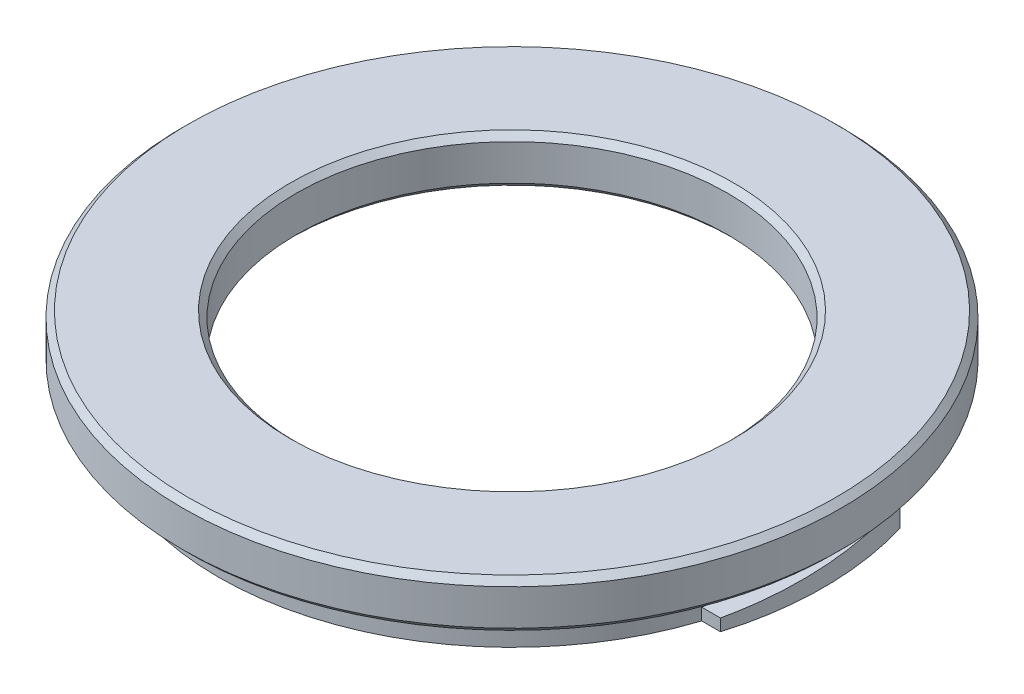
ISO-10303-21;
HEADER;
FILE_DESCRIPTION(('STEP AP214'),'2;1');
FILE_NAME('part.step','',(''),(''),'','','');
FILE_SCHEMA(('AUTOMOTIVE_DESIGN { 1 0 10303 214 1 1 1 1 }'));
ENDSEC;
DATA;
#1=APPLICATION_CONTEXT('core data for automotive mechanical design processes');
#2=APPLICATION_PROTOCOL_DEFINITION('international standard','automotive_design',2000,#1);
#3=PRODUCT_CONTEXT('',#1,'mechanical');
#4=PRODUCT('Part','Part','',(#3));
#5=PRODUCT_RELATED_PRODUCT_CATEGORY('part','',(#4));
#6=PRODUCT_DEFINITION_FORMATION('','',#4);
#7=PRODUCT_DEFINITION_CONTEXT('part definition',#1,'design');
#8=PRODUCT_DEFINITION('design','',#6,#7);
#9=PRODUCT_DEFINITION_SHAPE('','',#8);
#10=(LENGTH_UNIT() NAMED_UNIT(*) SI_UNIT(.MILLI.,.METRE.));
#11=(NAMED_UNIT(*) PLANE_ANGLE_UNIT() SI_UNIT($,.RADIAN.));
#12=(NAMED_UNIT(*) SI_UNIT($,.STERADIAN.) SOLID_ANGLE_UNIT());
#13=UNCERTAINTY_MEASURE_WITH_UNIT(LENGTH_MEASURE(1.E-05),#10,'distance_accuracy_value','');
#14=(GEOMETRIC_REPRESENTATION_CONTEXT(3) GLOBAL_UNCERTAINTY_ASSIGNED_CONTEXT((#13)) GLOBAL_UNIT_ASSIGNED_CONTEXT((#10,
#11,#12)) REPRESENTATION_CONTEXT('',''));
#15=CARTESIAN_POINT('',(0.,0.,0.));
#16=DIRECTION('',(0.,0.,1.));
#17=DIRECTION('',(1.,0.,0.));
#18=AXIS2_PLACEMENT_3D('',#15,#16,#17);
#19=CARTESIAN_POINT('',(0.,-13.5086932447398,0.));
#20=DIRECTION('',(0.,-1.,0.));
#21=DIRECTION('',(0.,0.,-1.));
#22=AXIS2_PLACEMENT_3D('',#19,#20,#21);
#23=CYLINDRICAL_SURFACE('',#22,24.5);
#24=CARTESIAN_POINT('',(0.,-4.,0.));
#25=DIRECTION('',(0.,-1.,0.));
#26=DIRECTION('',(0.,0.,-1.));
#27=AXIS2_PLACEMENT_3D('',#24,#25,#26);
#28=CIRCLE('',#27,24.5);
#29=CARTESIAN_POINT('',(0.,-4.,-24.5));
#30=VERTEX_POINT('',#29);
#31=EDGE_CURVE('E155',#30,#30,#28,.T.);
#32=ORIENTED_EDGE('',*,*,#31,.T.);
#33=EDGE_LOOP('',(#32));
#34=FACE_BOUND('',#33,.T.);
#35=DIRECTION('',(0.,-1.,0.));
#36=VECTOR('',#35,1.);
#37=CARTESIAN_POINT('',(-23.3238075793812,-13.5086932447398,7.5));
#38=LINE('',#37,#36);
#39=CARTESIAN_POINT('',(-23.3238075793812,-7.,7.5));
#40=VERTEX_POINT('',#39);
#41=CARTESIAN_POINT('',(-23.3238075793812,-5.,7.5));
#42=VERTEX_POINT('',#41);
#43=EDGE_CURVE('E134',#40,#42,#38,.F.);
#44=ORIENTED_EDGE('',*,*,#43,.F.);
#45=CARTESIAN_POINT('',(0.,-7.,0.));
#46=DIRECTION('',(0.,-1.,0.));
#47=DIRECTION('',(0.,0.,-1.));
#48=AXIS2_PLACEMENT_3D('',#45,#46,#47);
#49=CIRCLE('',#48,24.5);
#50=CARTESIAN_POINT('',(23.3238075793812,-7.,7.5));
#51=VERTEX_POINT('',#50);
#52=EDGE_CURVE('E122',#51,#40,#49,.T.);
#53=ORIENTED_EDGE('',*,*,#52,.F.);
#54=DIRECTION('',(0.,-1.,0.));
#55=VECTOR('',#54,1.);
#56=CARTESIAN_POINT('',(23.3238075793812,-13.5086932447398,7.5));
#57=LINE('',#56,#55);
#58=CARTESIAN_POINT('',(23.3238075793812,-6.,7.5));
#59=VERTEX_POINT('',#58);
#60=EDGE_CURVE('E144',#59,#51,#57,.T.);
#61=ORIENTED_EDGE('',*,*,#60,.F.);
#62=CARTESIAN_POINT('',(0.,-5.5,0.));
#63=DIRECTION('',(0.,-0.997785157856609,-0.066519010523774));
#64=DIRECTION('',(0.,-0.066519010523774,0.997785157856609));
#65=AXIS2_PLACEMENT_3D('',#62,#63,#64);
#66=ELLIPSE('',#65,24.5543840846757,24.5);
#67=CARTESIAN_POINT('',(23.3238075793812,-5.,-7.5));
#68=VERTEX_POINT('',#67);
#69=EDGE_CURVE('E147',#68,#59,#66,.T.);
#70=ORIENTED_EDGE('',*,*,#69,.F.);
#71=DIRECTION('',(0.,-1.,0.));
#72=VECTOR('',#71,1.);
#73=CARTESIAN_POINT('',(23.3238075793812,-13.5086932447398,-7.5));
#74=LINE('',#73,#72);
#75=CARTESIAN_POINT('',(23.3238075793812,-7.,-7.5));
#76=VERTEX_POINT('',#75);
#77=EDGE_CURVE('E150',#76,#68,#74,.F.);
#78=ORIENTED_EDGE('',*,*,#77,.F.);
#79=CARTESIAN_POINT('',(-23.3238075793812,-7.,-7.5));
#80=VERTEX_POINT('',#79);
#81=EDGE_CURVE('E153',#80,#76,#49,.T.);
#82=ORIENTED_EDGE('',*,*,#81,.F.);
#83=DIRECTION('',(0.,-1.,0.));
#84=VECTOR('',#83,1.);
#85=CARTESIAN_POINT('',(-23.3238075793812,-13.5086932447398,-7.5));
#86=LINE('',#85,#84);
#87=CARTESIAN_POINT('',(-23.3238075793812,-6.,-7.5));
#88=VERTEX_POINT('',#87);
#89=EDGE_CURVE('E123',#88,#80,#86,.T.);
#90=ORIENTED_EDGE('',*,*,#89,.F.);
#91=CARTESIAN_POINT('',(0.,-5.5,0.));
#92=DIRECTION('',(0.,-0.997785157856609,0.066519010523774));
#93=DIRECTION('',(0.,-0.066519010523774,-0.997785157856609));
#94=AXIS2_PLACEMENT_3D('',#91,#92,#93);
#95=ELLIPSE('',#94,24.5543840846757,24.5);
#96=EDGE_CURVE('E126',#42,#88,#95,.T.);
#97=ORIENTED_EDGE('',*,*,#96,.F.);
#98=EDGE_LOOP('',(#44,#53,#61,#70,#78,#82,#90,#97));
#99=FACE_BOUND('',#98,.T.);
#100=ADVANCED_FACE('F37',(#34,#99),#23,.T.);
#101=CARTESIAN_POINT('',(0.,-13.5086932447398,0.));
#102=DIRECTION('',(0.,-1.,0.));
#103=DIRECTION('',(0.,0.,-1.));
#104=AXIS2_PLACEMENT_3D('',#101,#102,#103);
#105=CYLINDRICAL_SURFACE('',#104,22.5);
#106=CARTESIAN_POINT('',(0.,-6.5,0.));
#107=DIRECTION('',(0.,1.,0.));
#108=DIRECTION('',(0.,0.,1.));
#109=AXIS2_PLACEMENT_3D('',#106,#107,#108);
#110=CIRCLE('',#109,22.5);
#111=CARTESIAN_POINT('',(0.,-6.5,22.5));
#112=VERTEX_POINT('',#111);
#113=EDGE_CURVE('E165',#112,#112,#110,.F.);
#114=ORIENTED_EDGE('',*,*,#113,.T.);
#115=EDGE_LOOP('',(#114));
#116=FACE_BOUND('',#115,.T.);
#117=CARTESIAN_POINT('',(0.,-5.,0.));
#118=DIRECTION('',(0.,-1.,0.));
#119=DIRECTION('',(0.,0.,-1.));
#120=AXIS2_PLACEMENT_3D('',#117,#118,#119);
#121=CIRCLE('',#120,22.5);
#122=CARTESIAN_POINT('',(0.,-5.,-22.5));
#123=VERTEX_POINT('',#122);
#124=EDGE_CURVE('E162',#123,#123,#121,.F.);
#125=ORIENTED_EDGE('',*,*,#124,.T.);
#126=EDGE_LOOP('',(#125));
#127=FACE_BOUND('',#126,.T.);
#128=ADVANCED_FACE('F208',(#116,#127),#105,.F.);
#129=CARTESIAN_POINT('',(0.,0.,0.));
#130=DIRECTION('',(0.,1.,0.));
#131=DIRECTION('',(0.,0.,1.));
#132=AXIS2_PLACEMENT_3D('',#129,#130,#131);
#133=PLANE('',#132);
#134=CARTESIAN_POINT('',(0.,0.,0.));
#135=DIRECTION('',(0.,1.,0.));
#136=DIRECTION('',(0.,0.,1.));
#137=AXIS2_PLACEMENT_3D('',#134,#135,#136);
#138=CIRCLE('',#137,27.);
#139=CARTESIAN_POINT('',(0.,0.,27.));
#140=VERTEX_POINT('',#139);
#141=EDGE_CURVE('E180',#140,#140,#138,.T.);
#142=ORIENTED_EDGE('',*,*,#141,.T.);
#143=EDGE_LOOP('',(#142));
#144=FACE_BOUND('',#143,.T.);
#145=CARTESIAN_POINT('',(0.,0.,0.));
#146=DIRECTION('',(0.,1.,0.));
#147=DIRECTION('',(0.,0.,1.));
#148=AXIS2_PLACEMENT_3D('',#145,#146,#147);
#149=CIRCLE('',#148,18.5);
#150=CARTESIAN_POINT('',(0.,0.,18.5));
#151=VERTEX_POINT('',#150);
#152=EDGE_CURVE('E177',#151,#151,#149,.F.);
#153=ORIENTED_EDGE('',*,*,#152,.T.);
#154=EDGE_LOOP('',(#153));
#155=FACE_BOUND('',#154,.T.);
#156=ADVANCED_FACE('F214',(#144,#155),#133,.T.);
#157=CARTESIAN_POINT('',(0.,-13.5086932447398,0.));
#158=DIRECTION('',(0.,-1.,0.));
#159=DIRECTION('',(0.,0.,-1.));
#160=AXIS2_PLACEMENT_3D('',#157,#158,#159);
#161=CYLINDRICAL_SURFACE('',#160,27.5);
#162=CARTESIAN_POINT('',(0.,-0.499999999999997,0.));
#163=DIRECTION('',(0.,1.,0.));
#164=DIRECTION('',(0.,0.,1.));
#165=AXIS2_PLACEMENT_3D('',#162,#163,#164);
#166=CIRCLE('',#165,27.5);
#167=CARTESIAN_POINT('',(0.,-0.499999999999997,27.5));
#168=VERTEX_POINT('',#167);
#169=EDGE_CURVE('E174',#168,#168,#166,.F.);
#170=ORIENTED_EDGE('',*,*,#169,.T.);
#171=EDGE_LOOP('',(#170));
#172=FACE_BOUND('',#171,.T.);
#173=CARTESIAN_POINT('',(0.,-3.49999999999999,0.));
#174=DIRECTION('',(0.,-1.,0.));
#175=DIRECTION('',(0.,0.,-1.));
#176=AXIS2_PLACEMENT_3D('',#173,#174,#175);
#177=CIRCLE('',#176,27.5);
#178=CARTESIAN_POINT('',(0.,-3.49999999999999,-27.5));
#179=VERTEX_POINT('',#178);
#180=EDGE_CURVE('E171',#179,#179,#177,.F.);
#181=ORIENTED_EDGE('',*,*,#180,.T.);
#182=EDGE_LOOP('',(#181));
#183=FACE_BOUND('',#182,.T.);
#184=ADVANCED_FACE('F220',(#172,#183),#161,.T.);
#185=CARTESIAN_POINT('',(0.,-4.,0.));
#186=DIRECTION('',(0.,-1.,0.));
#187=DIRECTION('',(0.,0.,-1.));
#188=AXIS2_PLACEMENT_3D('',#185,#186,#187);
#189=PLANE('',#188);
#190=CARTESIAN_POINT('',(0.,-4.,0.));
#191=DIRECTION('',(0.,-1.,0.));
#192=DIRECTION('',(0.,0.,-1.));
#193=AXIS2_PLACEMENT_3D('',#190,#191,#192);
#194=CIRCLE('',#193,27.);
#195=CARTESIAN_POINT('',(0.,-4.,-27.));
#196=VERTEX_POINT('',#195);
#197=EDGE_CURVE('E183',#196,#196,#194,.T.);
#198=ORIENTED_EDGE('',*,*,#197,.T.);
#199=EDGE_LOOP('',(#198));
#200=FACE_BOUND('',#199,.T.);
#201=ORIENTED_EDGE('',*,*,#31,.F.);
#202=EDGE_LOOP('',(#201));
#203=FACE_BOUND('',#202,.T.);
#204=ADVANCED_FACE('F223',(#200,#203),#189,.T.);
#205=CARTESIAN_POINT('',(0.,-7.,0.));
#206=DIRECTION('',(0.,1.,0.));
#207=DIRECTION('',(0.,0.,1.));
#208=AXIS2_PLACEMENT_3D('',#205,#206,#207);
#209=PLANE('',#208);
#210=CARTESIAN_POINT('',(0.,-7.,0.));
#211=DIRECTION('',(0.,1.,0.));
#212=DIRECTION('',(0.,0.,1.));
#213=AXIS2_PLACEMENT_3D('',#210,#211,#212);
#214=CIRCLE('',#213,23.);
#215=CARTESIAN_POINT('',(0.,-7.,23.));
#216=VERTEX_POINT('',#215);
#217=EDGE_CURVE('E168',#216,#216,#214,.T.);
#218=ORIENTED_EDGE('',*,*,#217,.T.);
#219=EDGE_LOOP('',(#218));
#220=FACE_BOUND('',#219,.T.);
#221=DIRECTION('',(1.,0.,0.));
#222=VECTOR('',#221,1.);
#223=CARTESIAN_POINT('',(-30.,-7.,7.5));
#224=LINE('',#223,#222);
#225=CARTESIAN_POINT('',(-24.8947785690092,-7.,7.5));
#226=VERTEX_POINT('',#225);
#227=EDGE_CURVE('E114',#226,#40,#224,.T.);
#228=ORIENTED_EDGE('',*,*,#227,.F.);
#229=CARTESIAN_POINT('',(0.,-7.,0.));
#230=DIRECTION('',(0.,1.,0.));
#231=DIRECTION('',(-1.,0.,0.));
#232=AXIS2_PLACEMENT_3D('',#229,#230,#231);
#233=CIRCLE('',#232,26.);
#234=CARTESIAN_POINT('',(-24.8947785690092,-7.,-7.5));
#235=VERTEX_POINT('',#234);
#236=EDGE_CURVE('E100',#235,#226,#233,.T.);
#237=ORIENTED_EDGE('',*,*,#236,.F.);
#238=DIRECTION('',(1.,0.,0.));
#239=VECTOR('',#238,1.);
#240=CARTESIAN_POINT('',(-30.,-7.,-7.5));
#241=LINE('',#240,#239);
#242=EDGE_CURVE('E423',#235,#80,#241,.T.);
#243=ORIENTED_EDGE('',*,*,#242,.T.);
#244=ORIENTED_EDGE('',*,*,#81,.T.);
#245=DIRECTION('',(-1.,0.,0.));
#246=VECTOR('',#245,1.);
#247=CARTESIAN_POINT('',(30.,-7.,-7.5));
#248=LINE('',#247,#246);
#249=CARTESIAN_POINT('',(24.8947785690092,-6.99999999999999,-7.5));
#250=VERTEX_POINT('',#249);
#251=EDGE_CURVE('E142',#250,#76,#248,.T.);
#252=ORIENTED_EDGE('',*,*,#251,.F.);
#253=CARTESIAN_POINT('',(24.8947785690092,-6.99999999999999,7.5));
#254=VERTEX_POINT('',#253);
#255=EDGE_CURVE('E108',#254,#250,#233,.T.);
#256=ORIENTED_EDGE('',*,*,#255,.F.);
#257=DIRECTION('',(-1.,0.,0.));
#258=VECTOR('',#257,1.);
#259=CARTESIAN_POINT('',(30.,-7.,7.5));
#260=LINE('',#259,#258);
#261=EDGE_CURVE('E136',#254,#51,#260,.T.);
#262=ORIENTED_EDGE('',*,*,#261,.T.);
#263=ORIENTED_EDGE('',*,*,#52,.T.);
#264=EDGE_LOOP('',(#228,#237,#243,#244,#252,#256,#262,#263));
#265=FACE_BOUND('',#264,.T.);
#266=ADVANCED_FACE('F120',(#220,#265),#209,.F.);
#267=CARTESIAN_POINT('',(0.,-4.,0.));
#268=DIRECTION('',(0.,-1.,0.));
#269=DIRECTION('',(0.,0.,-1.));
#270=AXIS2_PLACEMENT_3D('',#267,#268,#269);
#271=CIRCLE('',#270,18.5);
#272=CARTESIAN_POINT('',(0.,-4.,-18.5));
#273=VERTEX_POINT('',#272);
#274=EDGE_CURVE('E11',#273,#273,#271,.F.);
#275=ORIENTED_EDGE('',*,*,#274,.T.);
#276=EDGE_LOOP('',(#275));
#277=FACE_BOUND('',#276,.T.);
#278=CARTESIAN_POINT('',(0.,-4.,0.));
#279=DIRECTION('',(0.,-1.,0.));
#280=DIRECTION('',(0.,0.,-1.));
#281=AXIS2_PLACEMENT_3D('',#278,#279,#280);
#282=CIRCLE('',#281,21.5);
#283=CARTESIAN_POINT('',(0.,-4.,-21.5));
#284=VERTEX_POINT('',#283);
#285=EDGE_CURVE('E159',#284,#284,#282,.T.);
#286=ORIENTED_EDGE('',*,*,#285,.T.);
#287=EDGE_LOOP('',(#286));
#288=FACE_BOUND('',#287,.T.);
#289=ADVANCED_FACE('F252',(#277,#288),#189,.T.);
#290=CARTESIAN_POINT('',(0.,-13.5086932447398,0.));
#291=DIRECTION('',(0.,-1.,0.));
#292=DIRECTION('',(0.,0.,-1.));
#293=AXIS2_PLACEMENT_3D('',#290,#291,#292);
#294=CYLINDRICAL_SURFACE('',#293,18.);
#295=CARTESIAN_POINT('',(0.,-3.5,0.));
#296=DIRECTION('',(0.,-1.,0.));
#297=DIRECTION('',(0.,0.,-1.));
#298=AXIS2_PLACEMENT_3D('',#295,#296,#297);
#299=CIRCLE('',#298,18.);
#300=CARTESIAN_POINT('',(0.,-3.5,-18.));
#301=VERTEX_POINT('',#300);
#302=EDGE_CURVE('E45',#301,#301,#299,.T.);
#303=ORIENTED_EDGE('',*,*,#302,.T.);
#304=EDGE_LOOP('',(#303));
#305=FACE_BOUND('',#304,.T.);
#306=CARTESIAN_POINT('',(0.,-0.500000000000011,0.));
#307=DIRECTION('',(0.,1.,0.));
#308=DIRECTION('',(0.,0.,1.));
#309=AXIS2_PLACEMENT_3D('',#306,#307,#308);
#310=CIRCLE('',#309,18.);
#311=CARTESIAN_POINT('',(0.,-0.500000000000011,18.));
#312=VERTEX_POINT('',#311);
#313=EDGE_CURVE('E186',#312,#312,#310,.T.);
#314=ORIENTED_EDGE('',*,*,#313,.T.);
#315=EDGE_LOOP('',(#314));
#316=FACE_BOUND('',#315,.T.);
#317=ADVANCED_FACE('F191',(#305,#316),#294,.F.);
#318=CARTESIAN_POINT('',(30.,-5.,-7.5));
#319=DIRECTION('',(0.,0.,1.));
#320=DIRECTION('',(1.,0.,0.));
#321=AXIS2_PLACEMENT_3D('',#318,#319,#320);
#322=PLANE('',#321);
#323=DIRECTION('',(-1.,0.,0.));
#324=VECTOR('',#323,1.);
#325=CARTESIAN_POINT('',(30.,-5.,-7.5));
#326=LINE('',#325,#324);
#327=CARTESIAN_POINT('',(24.8947785690092,-5.,-7.5));
#328=VERTEX_POINT('',#327);
#329=EDGE_CURVE('E140',#328,#68,#326,.T.);
#330=ORIENTED_EDGE('',*,*,#329,.F.);
#331=DIRECTION('',(0.,1.,0.));
#332=VECTOR('',#331,1.);
#333=CARTESIAN_POINT('',(24.8947785690092,1.41062813627627,-7.5));
#334=LINE('',#333,#332);
#335=EDGE_CURVE('E428',#328,#250,#334,.F.);
#336=ORIENTED_EDGE('',*,*,#335,.T.);
#337=ORIENTED_EDGE('',*,*,#251,.T.);
#338=ORIENTED_EDGE('',*,*,#77,.T.);
#339=EDGE_LOOP('',(#330,#336,#337,#338));
#340=FACE_BOUND('',#339,.T.);
#341=ADVANCED_FACE('F264',(#340),#322,.F.);
#342=CARTESIAN_POINT('',(30.,-6.,7.5));
#343=DIRECTION('',(0.,-0.997785157856609,-0.066519010523774));
#344=DIRECTION('',(0.,0.066519010523774,-0.997785157856609));
#345=AXIS2_PLACEMENT_3D('',#342,#343,#344);
#346=PLANE('',#345);
#347=DIRECTION('',(-1.,0.,0.));
#348=VECTOR('',#347,1.);
#349=CARTESIAN_POINT('',(30.,-6.,7.5));
#350=LINE('',#349,#348);
#351=CARTESIAN_POINT('',(24.8947785690092,-6.,7.5));
#352=VERTEX_POINT('',#351);
#353=EDGE_CURVE('E138',#352,#59,#350,.T.);
#354=ORIENTED_EDGE('',*,*,#353,.F.);
#355=CARTESIAN_POINT('',(0.,-5.5,0.));
#356=DIRECTION('',(0.,-0.997785157856609,-0.066519010523774));
#357=DIRECTION('',(0.,0.066519010523774,-0.997785157856609));
#358=AXIS2_PLACEMENT_3D('',#355,#356,#357);
#359=ELLIPSE('',#358,26.057713722513,26.);
#360=EDGE_CURVE('E52',#352,#328,#359,.F.);
#361=ORIENTED_EDGE('',*,*,#360,.T.);
#362=ORIENTED_EDGE('',*,*,#329,.T.);
#363=ORIENTED_EDGE('',*,*,#69,.T.);
#364=EDGE_LOOP('',(#354,#361,#362,#363));
#365=FACE_BOUND('',#364,.T.);
#366=ADVANCED_FACE('F271',(#365),#346,.F.);
#367=CARTESIAN_POINT('',(30.,-7.,7.5));
#368=DIRECTION('',(0.,0.,-1.));
#369=DIRECTION('',(-1.,0.,0.));
#370=AXIS2_PLACEMENT_3D('',#367,#368,#369);
#371=PLANE('',#370);
#372=ORIENTED_EDGE('',*,*,#261,.F.);
#373=DIRECTION('',(0.,1.,0.));
#374=VECTOR('',#373,1.);
#375=CARTESIAN_POINT('',(24.8947785690092,1.41062813627627,7.5));
#376=LINE('',#375,#374);
#377=EDGE_CURVE('E117',#254,#352,#376,.T.);
#378=ORIENTED_EDGE('',*,*,#377,.T.);
#379=ORIENTED_EDGE('',*,*,#353,.T.);
#380=ORIENTED_EDGE('',*,*,#60,.T.);
#381=EDGE_LOOP('',(#372,#378,#379,#380));
#382=FACE_BOUND('',#381,.T.);
#383=ADVANCED_FACE('F277',(#382),#371,.F.);
#384=CARTESIAN_POINT('',(-30.,-5.,7.5));
#385=DIRECTION('',(0.,0.,-1.));
#386=DIRECTION('',(-1.,0.,0.));
#387=AXIS2_PLACEMENT_3D('',#384,#385,#386);
#388=PLANE('',#387);
#389=DIRECTION('',(1.,0.,0.));
#390=VECTOR('',#389,1.);
#391=CARTESIAN_POINT('',(-30.,-5.,7.5));
#392=LINE('',#391,#390);
#393=CARTESIAN_POINT('',(-24.8947785690092,-5.,7.5));
#394=VERTEX_POINT('',#393);
#395=EDGE_CURVE('E116',#394,#42,#392,.T.);
#396=ORIENTED_EDGE('',*,*,#395,.F.);
#397=DIRECTION('',(0.,1.,0.));
#398=VECTOR('',#397,1.);
#399=CARTESIAN_POINT('',(-24.8947785690092,1.41062813627626,7.5));
#400=LINE('',#399,#398);
#401=EDGE_CURVE('E103',#394,#226,#400,.F.);
#402=ORIENTED_EDGE('',*,*,#401,.T.);
#403=ORIENTED_EDGE('',*,*,#227,.T.);
#404=ORIENTED_EDGE('',*,*,#43,.T.);
#405=EDGE_LOOP('',(#396,#402,#403,#404));
#406=FACE_BOUND('',#405,.T.);
#407=ADVANCED_FACE('F112',(#406),#388,.F.);
#408=CARTESIAN_POINT('',(-30.,-6.,-7.5));
#409=DIRECTION('',(0.,-0.997785157856609,0.066519010523774));
#410=DIRECTION('',(0.,-0.066519010523774,-0.997785157856609));
#411=AXIS2_PLACEMENT_3D('',#408,#409,#410);
#412=PLANE('',#411);
#413=DIRECTION('',(1.,0.,0.));
#414=VECTOR('',#413,1.);
#415=CARTESIAN_POINT('',(-30.,-6.,-7.5));
#416=LINE('',#415,#414);
#417=CARTESIAN_POINT('',(-24.8947785690092,-6.,-7.5));
#418=VERTEX_POINT('',#417);
#419=EDGE_CURVE('E128',#418,#88,#416,.T.);
#420=ORIENTED_EDGE('',*,*,#419,.F.);
#421=CARTESIAN_POINT('',(0.,-5.5,0.));
#422=DIRECTION('',(0.,-0.997785157856609,0.066519010523774));
#423=DIRECTION('',(0.,0.066519010523774,0.997785157856609));
#424=AXIS2_PLACEMENT_3D('',#421,#422,#423);
#425=ELLIPSE('',#424,26.057713722513,26.);
#426=EDGE_CURVE('E60',#418,#394,#425,.F.);
#427=ORIENTED_EDGE('',*,*,#426,.T.);
#428=ORIENTED_EDGE('',*,*,#395,.T.);
#429=ORIENTED_EDGE('',*,*,#96,.T.);
#430=EDGE_LOOP('',(#420,#427,#428,#429));
#431=FACE_BOUND('',#430,.T.);
#432=ADVANCED_FACE('F284',(#431),#412,.F.);
#433=CARTESIAN_POINT('',(-30.,-7.,-7.5));
#434=DIRECTION('',(0.,0.,1.));
#435=DIRECTION('',(1.,0.,0.));
#436=AXIS2_PLACEMENT_3D('',#433,#434,#435);
#437=PLANE('',#436);
#438=ORIENTED_EDGE('',*,*,#242,.F.);
#439=DIRECTION('',(0.,1.,0.));
#440=VECTOR('',#439,1.);
#441=CARTESIAN_POINT('',(-24.8947785690092,1.41062813627626,-7.5));
#442=LINE('',#441,#440);
#443=EDGE_CURVE('E104',#235,#418,#442,.T.);
#444=ORIENTED_EDGE('',*,*,#443,.T.);
#445=ORIENTED_EDGE('',*,*,#419,.T.);
#446=ORIENTED_EDGE('',*,*,#89,.T.);
#447=EDGE_LOOP('',(#438,#444,#445,#446));
#448=FACE_BOUND('',#447,.T.);
#449=ADVANCED_FACE('F287',(#448),#437,.F.);
#450=CARTESIAN_POINT('',(0.,1.41062813627627,0.));
#451=DIRECTION('',(0.,1.,0.));
#452=DIRECTION('',(-1.,0.,0.));
#453=AXIS2_PLACEMENT_3D('',#450,#451,#452);
#454=CYLINDRICAL_SURFACE('',#453,26.);
#455=ORIENTED_EDGE('',*,*,#426,.F.);
#456=ORIENTED_EDGE('',*,*,#443,.F.);
#457=ORIENTED_EDGE('',*,*,#236,.T.);
#458=ORIENTED_EDGE('',*,*,#401,.F.);
#459=EDGE_LOOP('',(#455,#456,#457,#458));
#460=FACE_BOUND('',#459,.T.);
#461=ADVANCED_FACE('F102',(#460),#454,.T.);
#462=ORIENTED_EDGE('',*,*,#360,.F.);
#463=ORIENTED_EDGE('',*,*,#377,.F.);
#464=ORIENTED_EDGE('',*,*,#255,.T.);
#465=ORIENTED_EDGE('',*,*,#335,.F.);
#466=EDGE_LOOP('',(#462,#463,#464,#465));
#467=FACE_BOUND('',#466,.T.);
#468=ADVANCED_FACE('F232',(#467),#454,.T.);
#469=CARTESIAN_POINT('',(0.,-4.,0.));
#470=DIRECTION('',(0.,-1.,0.));
#471=DIRECTION('',(0.,0.,-1.));
#472=AXIS2_PLACEMENT_3D('',#469,#470,#471);
#473=CONICAL_SURFACE('',#472,21.5,0.785398163397455);
#474=ORIENTED_EDGE('',*,*,#124,.F.);
#475=EDGE_LOOP('',(#474));
#476=FACE_BOUND('',#475,.T.);
#477=ORIENTED_EDGE('',*,*,#285,.F.);
#478=EDGE_LOOP('',(#477));
#479=FACE_BOUND('',#478,.T.);
#480=ADVANCED_FACE('F228',(#476,#479),#473,.F.);
#481=CARTESIAN_POINT('',(0.,-6.5,0.));
#482=DIRECTION('',(0.,-1.,0.));
#483=DIRECTION('',(0.,0.,-1.));
#484=AXIS2_PLACEMENT_3D('',#481,#482,#483);
#485=CONICAL_SURFACE('',#484,22.5,0.785398163397459);
#486=ORIENTED_EDGE('',*,*,#217,.F.);
#487=EDGE_LOOP('',(#486));
#488=FACE_BOUND('',#487,.T.);
#489=ORIENTED_EDGE('',*,*,#113,.F.);
#490=EDGE_LOOP('',(#489));
#491=FACE_BOUND('',#490,.T.);
#492=ADVANCED_FACE('F231',(#488,#491),#485,.F.);
#493=CARTESIAN_POINT('',(0.,-0.499999999999997,0.));
#494=DIRECTION('',(0.,-1.,0.));
#495=DIRECTION('',(0.,0.,-1.));
#496=AXIS2_PLACEMENT_3D('',#493,#494,#495);
#497=CONICAL_SURFACE('',#496,27.5,0.785398163397452);
#498=ORIENTED_EDGE('',*,*,#141,.F.);
#499=EDGE_LOOP('',(#498));
#500=FACE_BOUND('',#499,.T.);
#501=ORIENTED_EDGE('',*,*,#169,.F.);
#502=EDGE_LOOP('',(#501));
#503=FACE_BOUND('',#502,.T.);
#504=ADVANCED_FACE('F203',(#500,#503),#497,.T.);
#505=CARTESIAN_POINT('',(0.,-4.,0.));
#506=DIRECTION('',(0.,1.,0.));
#507=DIRECTION('',(0.,0.,1.));
#508=AXIS2_PLACEMENT_3D('',#505,#506,#507);
#509=CONICAL_SURFACE('',#508,27.,0.785398163397441);
#510=ORIENTED_EDGE('',*,*,#180,.F.);
#511=EDGE_LOOP('',(#510));
#512=FACE_BOUND('',#511,.T.);
#513=ORIENTED_EDGE('',*,*,#197,.F.);
#514=EDGE_LOOP('',(#513));
#515=FACE_BOUND('',#514,.T.);
#516=ADVANCED_FACE('F196',(#512,#515),#509,.T.);
#517=CARTESIAN_POINT('',(0.,-3.5,0.));
#518=DIRECTION('',(0.,-1.,0.));
#519=DIRECTION('',(0.,0.,-1.));
#520=AXIS2_PLACEMENT_3D('',#517,#518,#519);
#521=CONICAL_SURFACE('',#520,18.,0.785398163397448);
#522=ORIENTED_EDGE('',*,*,#274,.F.);
#523=EDGE_LOOP('',(#522));
#524=FACE_BOUND('',#523,.T.);
#525=ORIENTED_EDGE('',*,*,#302,.F.);
#526=EDGE_LOOP('',(#525));
#527=FACE_BOUND('',#526,.T.);
#528=ADVANCED_FACE('F194',(#524,#527),#521,.F.);
#529=CARTESIAN_POINT('',(0.,0.,0.));
#530=DIRECTION('',(0.,1.,0.));
#531=DIRECTION('',(0.,0.,1.));
#532=AXIS2_PLACEMENT_3D('',#529,#530,#531);
#533=CONICAL_SURFACE('',#532,18.5,0.785398163397434);
#534=ORIENTED_EDGE('',*,*,#313,.F.);
#535=EDGE_LOOP('',(#534));
#536=FACE_BOUND('',#535,.T.);
#537=ORIENTED_EDGE('',*,*,#152,.F.);
#538=EDGE_LOOP('',(#537));
#539=FACE_BOUND('',#538,.T.);
#540=ADVANCED_FACE('F39',(#536,#539),#533,.F.);
#541=CLOSED_SHELL('',(#100,#128,#156,#184,#204,#266,#289,#317,#341,#366,#383,#407,#432,#449,
#461,#468,#480,#492,#504,#516,#528,#540));
#542=MANIFOLD_SOLID_BREP('B2',#541);
#543=ADVANCED_BREP_SHAPE_REPRESENTATION('',(#18,#542),#14);
#544=SHAPE_DEFINITION_REPRESENTATION(#9,#543);
ENDSEC;
END-ISO-10303-21;
